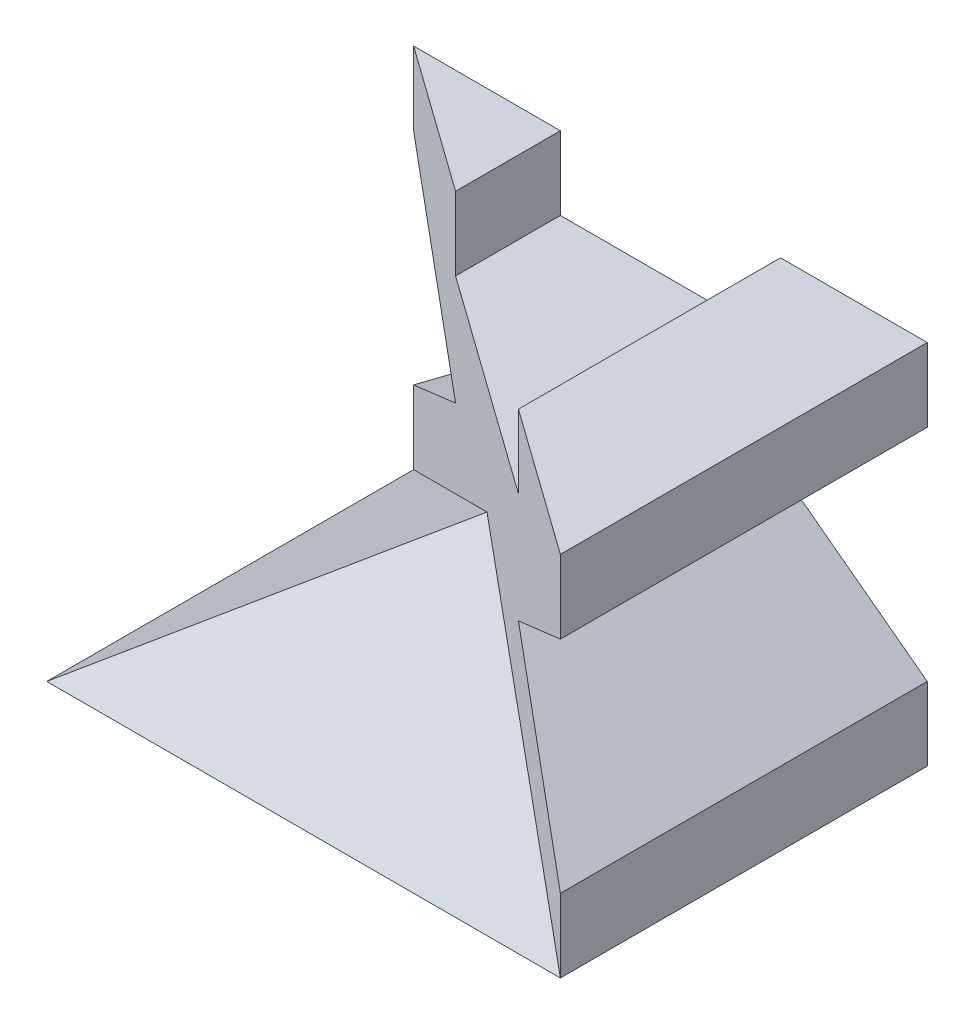
ISO-10303-21;
HEADER;
FILE_DESCRIPTION(('STEP AP214'),'2;1');
FILE_NAME('part.step','',(''),(''),'','','');
FILE_SCHEMA(('AUTOMOTIVE_DESIGN { 1 0 10303 214 1 1 1 1 }'));
ENDSEC;
DATA;
#1=APPLICATION_CONTEXT('core data for automotive mechanical design processes');
#2=APPLICATION_PROTOCOL_DEFINITION('international standard','automotive_design',2000,#1);
#3=PRODUCT_CONTEXT('',#1,'mechanical');
#4=PRODUCT('Part','Part','',(#3));
#5=PRODUCT_RELATED_PRODUCT_CATEGORY('part','',(#4));
#6=PRODUCT_DEFINITION_FORMATION('','',#4);
#7=PRODUCT_DEFINITION_CONTEXT('part definition',#1,'design');
#8=PRODUCT_DEFINITION('design','',#6,#7);
#9=PRODUCT_DEFINITION_SHAPE('','',#8);
#10=(LENGTH_UNIT() NAMED_UNIT(*) SI_UNIT(.MILLI.,.METRE.));
#11=(NAMED_UNIT(*) PLANE_ANGLE_UNIT() SI_UNIT($,.RADIAN.));
#12=(NAMED_UNIT(*) SI_UNIT($,.STERADIAN.) SOLID_ANGLE_UNIT());
#13=UNCERTAINTY_MEASURE_WITH_UNIT(LENGTH_MEASURE(1.E-05),#10,'distance_accuracy_value','');
#14=(GEOMETRIC_REPRESENTATION_CONTEXT(3) GLOBAL_UNCERTAINTY_ASSIGNED_CONTEXT((#13)) GLOBAL_UNIT_ASSIGNED_CONTEXT((#10,
#11,#12)) REPRESENTATION_CONTEXT('',''));
#15=CARTESIAN_POINT('',(0.,0.,0.));
#16=DIRECTION('',(0.,0.,1.));
#17=DIRECTION('',(1.,0.,0.));
#18=AXIS2_PLACEMENT_3D('',#15,#16,#17);
#19=CARTESIAN_POINT('',(3.5,1.5,5.));
#20=DIRECTION('',(-1.,0.,0.));
#21=DIRECTION('',(0.,0.,1.));
#22=AXIS2_PLACEMENT_3D('',#19,#20,#21);
#23=PLANE('',#22);
#24=DIRECTION('',(0.,1.,0.));
#25=VECTOR('',#24,1.);
#26=CARTESIAN_POINT('',(3.5,1.5,0.));
#27=LINE('',#26,#25);
#28=CARTESIAN_POINT('',(3.5,1.5,0.));
#29=VERTEX_POINT('',#28);
#30=CARTESIAN_POINT('',(3.5,2.5,0.));
#31=VERTEX_POINT('',#30);
#32=EDGE_CURVE('E223',#29,#31,#27,.T.);
#33=ORIENTED_EDGE('',*,*,#32,.T.);
#34=DIRECTION('',(0.,0.,-1.));
#35=VECTOR('',#34,1.);
#36=CARTESIAN_POINT('',(3.5,2.5,5.));
#37=LINE('',#36,#35);
#38=CARTESIAN_POINT('',(3.5,2.5,5.));
#39=VERTEX_POINT('',#38);
#40=EDGE_CURVE('E12',#39,#31,#37,.T.);
#41=ORIENTED_EDGE('',*,*,#40,.F.);
#42=DIRECTION('',(0.,1.,0.));
#43=VECTOR('',#42,1.);
#44=CARTESIAN_POINT('',(3.5,1.5,5.));
#45=LINE('',#44,#43);
#46=CARTESIAN_POINT('',(3.5,1.5,5.));
#47=VERTEX_POINT('',#46);
#48=EDGE_CURVE('E163',#47,#39,#45,.T.);
#49=ORIENTED_EDGE('',*,*,#48,.F.);
#50=DIRECTION('',(0.,0.,-1.));
#51=VECTOR('',#50,1.);
#52=CARTESIAN_POINT('',(3.5,1.5,5.));
#53=LINE('',#52,#51);
#54=EDGE_CURVE('E162',#47,#29,#53,.T.);
#55=ORIENTED_EDGE('',*,*,#54,.T.);
#56=EDGE_LOOP('',(#33,#41,#49,#55));
#57=FACE_BOUND('',#56,.T.);
#58=ADVANCED_FACE('F35',(#57),#23,.F.);
#59=CARTESIAN_POINT('',(1.5,2.5,5.));
#60=DIRECTION('',(0.,-1.,0.));
#61=DIRECTION('',(0.,0.,-1.));
#62=AXIS2_PLACEMENT_3D('',#59,#60,#61);
#63=PLANE('',#62);
#64=DIRECTION('',(0.,0.,-1.));
#65=VECTOR('',#64,1.);
#66=CARTESIAN_POINT('',(1.5,2.5,5.));
#67=LINE('',#66,#65);
#68=CARTESIAN_POINT('',(1.5,2.5,3.57142857142857));
#69=VERTEX_POINT('',#68);
#70=CARTESIAN_POINT('',(1.5,2.5,0.));
#71=VERTEX_POINT('',#70);
#72=EDGE_CURVE('E43',#69,#71,#67,.T.);
#73=ORIENTED_EDGE('',*,*,#72,.F.);
#74=DIRECTION('',(-0.813733471206735,0.,-0.581238193719096));
#75=VECTOR('',#74,1.);
#76=CARTESIAN_POINT('',(-3.5,2.5,0.));
#77=LINE('',#76,#75);
#78=EDGE_CURVE('E243',#39,#69,#77,.T.);
#79=ORIENTED_EDGE('',*,*,#78,.F.);
#80=ORIENTED_EDGE('',*,*,#40,.T.);
#81=DIRECTION('',(-1.,0.,0.));
#82=VECTOR('',#81,1.);
#83=CARTESIAN_POINT('',(1.5,2.5,0.));
#84=LINE('',#83,#82);
#85=EDGE_CURVE('E220',#31,#71,#84,.T.);
#86=ORIENTED_EDGE('',*,*,#85,.T.);
#87=EDGE_LOOP('',(#73,#79,#80,#86));
#88=FACE_BOUND('',#87,.T.);
#89=ADVANCED_FACE('F283',(#88),#63,.F.);
#90=CARTESIAN_POINT('',(1.5,2.5,5.));
#91=DIRECTION('',(1.,0.,0.));
#92=DIRECTION('',(0.,1.,0.));
#93=AXIS2_PLACEMENT_3D('',#90,#91,#92);
#94=PLANE('',#93);
#95=DIRECTION('',(0.,0.,-1.));
#96=VECTOR('',#95,1.);
#97=CARTESIAN_POINT('',(1.5,1.5,5.));
#98=LINE('',#97,#96);
#99=CARTESIAN_POINT('',(1.5,1.5,3.57142857142857));
#100=VERTEX_POINT('',#99);
#101=CARTESIAN_POINT('',(1.5,1.5,0.));
#102=VERTEX_POINT('',#101);
#103=EDGE_CURVE('E186',#100,#102,#98,.T.);
#104=ORIENTED_EDGE('',*,*,#103,.F.);
#105=DIRECTION('',(0.,1.,0.));
#106=VECTOR('',#105,1.);
#107=CARTESIAN_POINT('',(1.5,2.5,3.57142857142857));
#108=LINE('',#107,#106);
#109=EDGE_CURVE('E225',#100,#69,#108,.T.);
#110=ORIENTED_EDGE('',*,*,#109,.T.);
#111=ORIENTED_EDGE('',*,*,#72,.T.);
#112=DIRECTION('',(0.,-1.,0.));
#113=VECTOR('',#112,1.);
#114=CARTESIAN_POINT('',(1.5,2.5,0.));
#115=LINE('',#114,#113);
#116=EDGE_CURVE('E217',#71,#102,#115,.T.);
#117=ORIENTED_EDGE('',*,*,#116,.T.);
#118=EDGE_LOOP('',(#104,#110,#111,#117));
#119=FACE_BOUND('',#118,.T.);
#120=ADVANCED_FACE('F288',(#119),#94,.F.);
#121=CARTESIAN_POINT('',(-1.5,1.5,5.));
#122=DIRECTION('',(0.,-1.,0.));
#123=DIRECTION('',(0.,0.,-1.));
#124=AXIS2_PLACEMENT_3D('',#121,#122,#123);
#125=PLANE('',#124);
#126=DIRECTION('',(0.,0.,-1.));
#127=VECTOR('',#126,1.);
#128=CARTESIAN_POINT('',(-1.5,1.5,5.));
#129=LINE('',#128,#127);
#130=CARTESIAN_POINT('',(-1.5,1.5,1.42857142857143));
#131=VERTEX_POINT('',#130);
#132=CARTESIAN_POINT('',(-1.5,1.5,0.));
#133=VERTEX_POINT('',#132);
#134=EDGE_CURVE('E188',#131,#133,#129,.T.);
#135=ORIENTED_EDGE('',*,*,#134,.F.);
#136=DIRECTION('',(0.813733471206735,0.,0.581238193719096));
#137=VECTOR('',#136,1.);
#138=CARTESIAN_POINT('',(0.189189189189189,1.5,2.63513513513513));
#139=LINE('',#138,#137);
#140=EDGE_CURVE('E229',#131,#100,#139,.T.);
#141=ORIENTED_EDGE('',*,*,#140,.T.);
#142=ORIENTED_EDGE('',*,*,#103,.T.);
#143=DIRECTION('',(-1.,0.,0.));
#144=VECTOR('',#143,1.);
#145=CARTESIAN_POINT('',(-1.5,1.5,0.));
#146=LINE('',#145,#144);
#147=EDGE_CURVE('E214',#102,#133,#146,.T.);
#148=ORIENTED_EDGE('',*,*,#147,.T.);
#149=EDGE_LOOP('',(#135,#141,#142,#148));
#150=FACE_BOUND('',#149,.T.);
#151=ADVANCED_FACE('F302',(#150),#125,.F.);
#152=CARTESIAN_POINT('',(-1.5,2.5,5.));
#153=DIRECTION('',(-1.,0.,0.));
#154=DIRECTION('',(0.,-1.,0.));
#155=AXIS2_PLACEMENT_3D('',#152,#153,#154);
#156=PLANE('',#155);
#157=DIRECTION('',(0.,0.,-1.));
#158=VECTOR('',#157,1.);
#159=CARTESIAN_POINT('',(-1.5,2.5,5.));
#160=LINE('',#159,#158);
#161=CARTESIAN_POINT('',(-1.5,2.5,1.42857142857143));
#162=VERTEX_POINT('',#161);
#163=CARTESIAN_POINT('',(-1.5,2.5,0.));
#164=VERTEX_POINT('',#163);
#165=EDGE_CURVE('E190',#162,#164,#160,.T.);
#166=ORIENTED_EDGE('',*,*,#165,.F.);
#167=DIRECTION('',(0.,-1.,0.));
#168=VECTOR('',#167,1.);
#169=CARTESIAN_POINT('',(-1.5,2.5,1.42857142857143));
#170=LINE('',#169,#168);
#171=EDGE_CURVE('E231',#162,#131,#170,.T.);
#172=ORIENTED_EDGE('',*,*,#171,.T.);
#173=ORIENTED_EDGE('',*,*,#134,.T.);
#174=DIRECTION('',(0.,1.,0.));
#175=VECTOR('',#174,1.);
#176=CARTESIAN_POINT('',(-1.5,2.5,0.));
#177=LINE('',#176,#175);
#178=EDGE_CURVE('E211',#133,#164,#177,.T.);
#179=ORIENTED_EDGE('',*,*,#178,.T.);
#180=EDGE_LOOP('',(#166,#172,#173,#179));
#181=FACE_BOUND('',#180,.T.);
#182=ADVANCED_FACE('F301',(#181),#156,.F.);
#183=CARTESIAN_POINT('',(-3.5,2.5,5.));
#184=DIRECTION('',(0.,-1.,0.));
#185=DIRECTION('',(0.,0.,-1.));
#186=AXIS2_PLACEMENT_3D('',#183,#184,#185);
#187=PLANE('',#186);
#188=DIRECTION('',(-1.,0.,0.));
#189=VECTOR('',#188,1.);
#190=CARTESIAN_POINT('',(-3.5,2.5,0.));
#191=LINE('',#190,#189);
#192=CARTESIAN_POINT('',(-3.5,2.5,0.));
#193=VERTEX_POINT('',#192);
#194=EDGE_CURVE('E208',#164,#193,#191,.T.);
#195=ORIENTED_EDGE('',*,*,#194,.T.);
#196=EDGE_CURVE('E180',#162,#193,#77,.T.);
#197=ORIENTED_EDGE('',*,*,#196,.F.);
#198=ORIENTED_EDGE('',*,*,#165,.T.);
#199=EDGE_LOOP('',(#195,#197,#198));
#200=FACE_BOUND('',#199,.T.);
#201=ADVANCED_FACE('F260',(#200),#187,.F.);
#202=CARTESIAN_POINT('',(-3.5,1.5,5.));
#203=DIRECTION('',(0.6,0.8,0.));
#204=DIRECTION('',(-0.8,0.6,0.));
#205=AXIS2_PLACEMENT_3D('',#202,#203,#204);
#206=PLANE('',#205);
#207=DIRECTION('',(0.,0.,-1.));
#208=VECTOR('',#207,1.);
#209=CARTESIAN_POINT('',(-1.5,0.,5.));
#210=LINE('',#209,#208);
#211=CARTESIAN_POINT('',(-1.5,0.,1.42857142857143));
#212=VERTEX_POINT('',#211);
#213=CARTESIAN_POINT('',(-1.5,0.,0.));
#214=VERTEX_POINT('',#213);
#215=EDGE_CURVE('E156',#212,#214,#210,.T.);
#216=ORIENTED_EDGE('',*,*,#215,.F.);
#217=DIRECTION('',(-0.694594513699567,0.520945885274675,-0.496138938356834));
#218=VECTOR('',#217,1.);
#219=CARTESIAN_POINT('',(-1.77692307692308,0.207692307692308,1.23076923076923));
#220=LINE('',#219,#218);
#221=CARTESIAN_POINT('',(-3.5,1.5,0.));
#222=VERTEX_POINT('',#221);
#223=EDGE_CURVE('E234',#212,#222,#220,.T.);
#224=ORIENTED_EDGE('',*,*,#223,.T.);
#225=DIRECTION('',(0.8,-0.6,0.));
#226=VECTOR('',#225,1.);
#227=CARTESIAN_POINT('',(-3.5,1.5,0.));
#228=LINE('',#227,#226);
#229=EDGE_CURVE('E202',#222,#214,#228,.T.);
#230=ORIENTED_EDGE('',*,*,#229,.T.);
#231=EDGE_LOOP('',(#216,#224,#230));
#232=FACE_BOUND('',#231,.T.);
#233=ADVANCED_FACE('F269',(#232),#206,.F.);
#234=CARTESIAN_POINT('',(-1.5,0.,5.));
#235=DIRECTION('',(0.6,-0.8,0.));
#236=DIRECTION('',(0.8,0.6,0.));
#237=AXIS2_PLACEMENT_3D('',#234,#235,#236);
#238=PLANE('',#237);
#239=DIRECTION('',(-0.8,-0.6,0.));
#240=VECTOR('',#239,1.);
#241=CARTESIAN_POINT('',(-1.5,0.,0.));
#242=LINE('',#241,#240);
#243=CARTESIAN_POINT('',(-3.5,-1.5,0.));
#244=VERTEX_POINT('',#243);
#245=EDGE_CURVE('E183',#214,#244,#242,.T.);
#246=ORIENTED_EDGE('',*,*,#245,.T.);
#247=DIRECTION('',(0.694594513699567,0.520945885274675,0.496138938356834));
#248=VECTOR('',#247,1.);
#249=CARTESIAN_POINT('',(-0.269230769230769,0.923076923076922,2.30769230769231));
#250=LINE('',#249,#248);
#251=EDGE_CURVE('E236',#244,#212,#250,.T.);
#252=ORIENTED_EDGE('',*,*,#251,.T.);
#253=ORIENTED_EDGE('',*,*,#215,.T.);
#254=EDGE_LOOP('',(#246,#252,#253));
#255=FACE_BOUND('',#254,.T.);
#256=ADVANCED_FACE('F271',(#255),#238,.F.);
#257=CARTESIAN_POINT('',(-3.5,-2.5,5.));
#258=DIRECTION('',(0.,1.,0.));
#259=DIRECTION('',(0.,0.,1.));
#260=AXIS2_PLACEMENT_3D('',#257,#258,#259);
#261=PLANE('',#260);
#262=DIRECTION('',(0.,0.,-1.));
#263=VECTOR('',#262,1.);
#264=CARTESIAN_POINT('',(3.5,-2.5,5.));
#265=LINE('',#264,#263);
#266=CARTESIAN_POINT('',(3.5,-2.5,5.));
#267=VERTEX_POINT('',#266);
#268=CARTESIAN_POINT('',(3.5,-2.5,0.));
#269=VERTEX_POINT('',#268);
#270=EDGE_CURVE('E150',#267,#269,#265,.T.);
#271=ORIENTED_EDGE('',*,*,#270,.F.);
#272=DIRECTION('',(-1.,0.,0.));
#273=VECTOR('',#272,1.);
#274=CARTESIAN_POINT('',(-3.5,-2.5,5.));
#275=LINE('',#274,#273);
#276=CARTESIAN_POINT('',(-3.5,-2.5,5.));
#277=VERTEX_POINT('',#276);
#278=EDGE_CURVE('E141',#267,#277,#275,.T.);
#279=ORIENTED_EDGE('',*,*,#278,.T.);
#280=DIRECTION('',(0.,0.,-1.));
#281=VECTOR('',#280,1.);
#282=CARTESIAN_POINT('',(-3.5,-2.5,0.));
#283=LINE('',#282,#281);
#284=CARTESIAN_POINT('',(-3.5,-2.5,0.));
#285=VERTEX_POINT('',#284);
#286=EDGE_CURVE('E147',#277,#285,#283,.T.);
#287=ORIENTED_EDGE('',*,*,#286,.T.);
#288=DIRECTION('',(1.,0.,0.));
#289=VECTOR('',#288,1.);
#290=CARTESIAN_POINT('',(-3.5,-2.5,0.));
#291=LINE('',#290,#289);
#292=EDGE_CURVE('E153',#285,#269,#291,.T.);
#293=ORIENTED_EDGE('',*,*,#292,.T.);
#294=EDGE_LOOP('',(#271,#279,#287,#293));
#295=FACE_BOUND('',#294,.T.);
#296=ADVANCED_FACE('F151',(#295),#261,.F.);
#297=CARTESIAN_POINT('',(3.5,-2.5,5.));
#298=DIRECTION('',(-1.,0.,0.));
#299=DIRECTION('',(0.,0.,1.));
#300=AXIS2_PLACEMENT_3D('',#297,#298,#299);
#301=PLANE('',#300);
#302=DIRECTION('',(0.,1.,0.));
#303=VECTOR('',#302,1.);
#304=CARTESIAN_POINT('',(3.5,-2.5,0.));
#305=LINE('',#304,#303);
#306=CARTESIAN_POINT('',(3.5,-1.5,0.));
#307=VERTEX_POINT('',#306);
#308=EDGE_CURVE('E175',#269,#307,#305,.T.);
#309=ORIENTED_EDGE('',*,*,#308,.T.);
#310=DIRECTION('',(0.,0.,-1.));
#311=VECTOR('',#310,1.);
#312=CARTESIAN_POINT('',(3.5,-1.5,5.));
#313=LINE('',#312,#311);
#314=CARTESIAN_POINT('',(3.5,-1.5,5.));
#315=VERTEX_POINT('',#314);
#316=EDGE_CURVE('E157',#315,#307,#313,.T.);
#317=ORIENTED_EDGE('',*,*,#316,.F.);
#318=DIRECTION('',(0.,1.,0.));
#319=VECTOR('',#318,1.);
#320=CARTESIAN_POINT('',(3.5,-2.5,5.));
#321=LINE('',#320,#319);
#322=EDGE_CURVE('E133',#267,#315,#321,.T.);
#323=ORIENTED_EDGE('',*,*,#322,.F.);
#324=ORIENTED_EDGE('',*,*,#270,.T.);
#325=EDGE_LOOP('',(#309,#317,#323,#324));
#326=FACE_BOUND('',#325,.T.);
#327=ADVANCED_FACE('F160',(#326),#301,.F.);
#328=CARTESIAN_POINT('',(1.5,0.,5.));
#329=DIRECTION('',(-0.6,-0.8,0.));
#330=DIRECTION('',(0.8,-0.6,0.));
#331=AXIS2_PLACEMENT_3D('',#328,#329,#330);
#332=PLANE('',#331);
#333=DIRECTION('',(0.,0.,-1.));
#334=VECTOR('',#333,1.);
#335=CARTESIAN_POINT('',(1.5,0.,5.));
#336=LINE('',#335,#334);
#337=CARTESIAN_POINT('',(1.5,0.,3.57142857142857));
#338=VERTEX_POINT('',#337);
#339=CARTESIAN_POINT('',(1.5,0.,0.));
#340=VERTEX_POINT('',#339);
#341=EDGE_CURVE('E164',#338,#340,#336,.T.);
#342=ORIENTED_EDGE('',*,*,#341,.F.);
#343=DIRECTION('',(0.694594513699567,-0.520945885274675,0.496138938356834));
#344=VECTOR('',#343,1.);
#345=CARTESIAN_POINT('',(1.99230769230769,-0.36923076923077,3.92307692307692));
#346=LINE('',#345,#344);
#347=EDGE_CURVE('E239',#338,#315,#346,.T.);
#348=ORIENTED_EDGE('',*,*,#347,.T.);
#349=ORIENTED_EDGE('',*,*,#316,.T.);
#350=DIRECTION('',(-0.8,0.6,0.));
#351=VECTOR('',#350,1.);
#352=CARTESIAN_POINT('',(1.5,0.,0.));
#353=LINE('',#352,#351);
#354=EDGE_CURVE('E196',#307,#340,#353,.T.);
#355=ORIENTED_EDGE('',*,*,#354,.T.);
#356=EDGE_LOOP('',(#342,#348,#349,#355));
#357=FACE_BOUND('',#356,.T.);
#358=ADVANCED_FACE('F322',(#357),#332,.F.);
#359=CARTESIAN_POINT('',(3.5,1.5,5.));
#360=DIRECTION('',(-0.6,0.8,0.));
#361=DIRECTION('',(-0.8,-0.6,0.));
#362=AXIS2_PLACEMENT_3D('',#359,#360,#361);
#363=PLANE('',#362);
#364=ORIENTED_EDGE('',*,*,#54,.F.);
#365=DIRECTION('',(-0.694594513699567,-0.520945885274675,-0.496138938356834));
#366=VECTOR('',#365,1.);
#367=CARTESIAN_POINT('',(3.5,1.5,5.));
#368=LINE('',#367,#366);
#369=EDGE_CURVE('E241',#47,#338,#368,.T.);
#370=ORIENTED_EDGE('',*,*,#369,.T.);
#371=ORIENTED_EDGE('',*,*,#341,.T.);
#372=DIRECTION('',(0.8,0.6,0.));
#373=VECTOR('',#372,1.);
#374=CARTESIAN_POINT('',(3.5,1.5,0.));
#375=LINE('',#374,#373);
#376=EDGE_CURVE('E59',#340,#29,#375,.T.);
#377=ORIENTED_EDGE('',*,*,#376,.T.);
#378=EDGE_LOOP('',(#364,#370,#371,#377));
#379=FACE_BOUND('',#378,.T.);
#380=ADVANCED_FACE('F325',(#379),#363,.F.);
#381=CARTESIAN_POINT('',(0.,0.,0.));
#382=DIRECTION('',(0.,0.,-1.));
#383=DIRECTION('',(-1.,0.,0.));
#384=AXIS2_PLACEMENT_3D('',#381,#382,#383);
#385=PLANE('',#384);
#386=ORIENTED_EDGE('',*,*,#32,.F.);
#387=ORIENTED_EDGE('',*,*,#376,.F.);
#388=ORIENTED_EDGE('',*,*,#354,.F.);
#389=ORIENTED_EDGE('',*,*,#308,.F.);
#390=ORIENTED_EDGE('',*,*,#292,.F.);
#391=DIRECTION('',(0.,-1.,0.));
#392=VECTOR('',#391,1.);
#393=CARTESIAN_POINT('',(-3.5,-2.5,0.));
#394=LINE('',#393,#392);
#395=EDGE_CURVE('E176',#244,#285,#394,.T.);
#396=ORIENTED_EDGE('',*,*,#395,.F.);
#397=ORIENTED_EDGE('',*,*,#245,.F.);
#398=ORIENTED_EDGE('',*,*,#229,.F.);
#399=DIRECTION('',(0.,-1.,0.));
#400=VECTOR('',#399,1.);
#401=CARTESIAN_POINT('',(-3.5,1.5,0.));
#402=LINE('',#401,#400);
#403=EDGE_CURVE('E205',#193,#222,#402,.T.);
#404=ORIENTED_EDGE('',*,*,#403,.F.);
#405=ORIENTED_EDGE('',*,*,#194,.F.);
#406=ORIENTED_EDGE('',*,*,#178,.F.);
#407=ORIENTED_EDGE('',*,*,#147,.F.);
#408=ORIENTED_EDGE('',*,*,#116,.F.);
#409=ORIENTED_EDGE('',*,*,#85,.F.);
#410=EDGE_LOOP('',(#386,#387,#388,#389,#390,#396,#397,#398,#404,#405,#406,#407,#408,#409));
#411=FACE_BOUND('',#410,.T.);
#412=ADVANCED_FACE('F264',(#411),#385,.T.);
#413=CARTESIAN_POINT('',(-3.5,-2.5,0.));
#414=DIRECTION('',(0.581238193719096,0.,-0.813733471206735));
#415=DIRECTION('',(-0.813733471206735,0.,-0.581238193719096));
#416=AXIS2_PLACEMENT_3D('',#413,#414,#415);
#417=PLANE('',#416);
#418=DIRECTION('',(0.703526470681448,0.502518907629606,0.502518907629606));
#419=VECTOR('',#418,1.);
#420=CARTESIAN_POINT('',(-3.5,-2.5,0.));
#421=LINE('',#420,#419);
#422=CARTESIAN_POINT('',(0.,0.,2.5));
#423=VERTEX_POINT('',#422);
#424=EDGE_CURVE('E136',#285,#423,#421,.T.);
#425=ORIENTED_EDGE('',*,*,#424,.T.);
#426=DIRECTION('',(-0.703526470681448,0.502518907629606,-0.502518907629606));
#427=VECTOR('',#426,1.);
#428=CARTESIAN_POINT('',(3.5,-2.5,5.));
#429=LINE('',#428,#427);
#430=EDGE_CURVE('E51',#267,#423,#429,.T.);
#431=ORIENTED_EDGE('',*,*,#430,.F.);
#432=ORIENTED_EDGE('',*,*,#322,.T.);
#433=ORIENTED_EDGE('',*,*,#347,.F.);
#434=ORIENTED_EDGE('',*,*,#369,.F.);
#435=ORIENTED_EDGE('',*,*,#48,.T.);
#436=ORIENTED_EDGE('',*,*,#78,.T.);
#437=ORIENTED_EDGE('',*,*,#109,.F.);
#438=ORIENTED_EDGE('',*,*,#140,.F.);
#439=ORIENTED_EDGE('',*,*,#171,.F.);
#440=ORIENTED_EDGE('',*,*,#196,.T.);
#441=ORIENTED_EDGE('',*,*,#403,.T.);
#442=ORIENTED_EDGE('',*,*,#223,.F.);
#443=ORIENTED_EDGE('',*,*,#251,.F.);
#444=ORIENTED_EDGE('',*,*,#395,.T.);
#445=EDGE_LOOP('',(#425,#431,#432,#433,#434,#435,#436,#437,#438,#439,#440,#441,#442,#443,#444));
#446=FACE_BOUND('',#445,.T.);
#447=ADVANCED_FACE('F130',(#446),#417,.F.);
#448=CARTESIAN_POINT('',(0.,0.,0.));
#449=DIRECTION('',(0.581238193719095,-0.813733471206736,0.));
#450=DIRECTION('',(0.813733471206736,0.581238193719095,0.));
#451=AXIS2_PLACEMENT_3D('',#448,#449,#450);
#452=PLANE('',#451);
#453=DIRECTION('',(-0.703526470681448,-0.502518907629606,0.502518907629606));
#454=VECTOR('',#453,1.);
#455=CARTESIAN_POINT('',(0.,0.,2.5));
#456=LINE('',#455,#454);
#457=EDGE_CURVE('E138',#423,#277,#456,.T.);
#458=ORIENTED_EDGE('',*,*,#457,.F.);
#459=ORIENTED_EDGE('',*,*,#424,.F.);
#460=ORIENTED_EDGE('',*,*,#286,.F.);
#461=EDGE_LOOP('',(#458,#459,#460));
#462=FACE_BOUND('',#461,.T.);
#463=ADVANCED_FACE('F273',(#462),#452,.F.);
#464=CARTESIAN_POINT('',(0.,1.25,1.25));
#465=DIRECTION('',(0.,0.707106781186547,0.707106781186548));
#466=DIRECTION('',(0.,-0.707106781186548,0.707106781186547));
#467=AXIS2_PLACEMENT_3D('',#464,#465,#466);
#468=PLANE('',#467);
#469=ORIENTED_EDGE('',*,*,#278,.F.);
#470=ORIENTED_EDGE('',*,*,#430,.T.);
#471=ORIENTED_EDGE('',*,*,#457,.T.);
#472=EDGE_LOOP('',(#469,#470,#471));
#473=FACE_BOUND('',#472,.T.);
#474=ADVANCED_FACE('F143',(#473),#468,.T.);
#475=CLOSED_SHELL('',(#58,#89,#120,#151,#182,#201,#233,#256,#296,#327,#358,#380,#412,#447,#463,#474));
#476=MANIFOLD_SOLID_BREP('B2',#475);
#477=ADVANCED_BREP_SHAPE_REPRESENTATION('',(#18,#476),#14);
#478=SHAPE_DEFINITION_REPRESENTATION(#9,#477);
ENDSEC;
END-ISO-10303-21;
